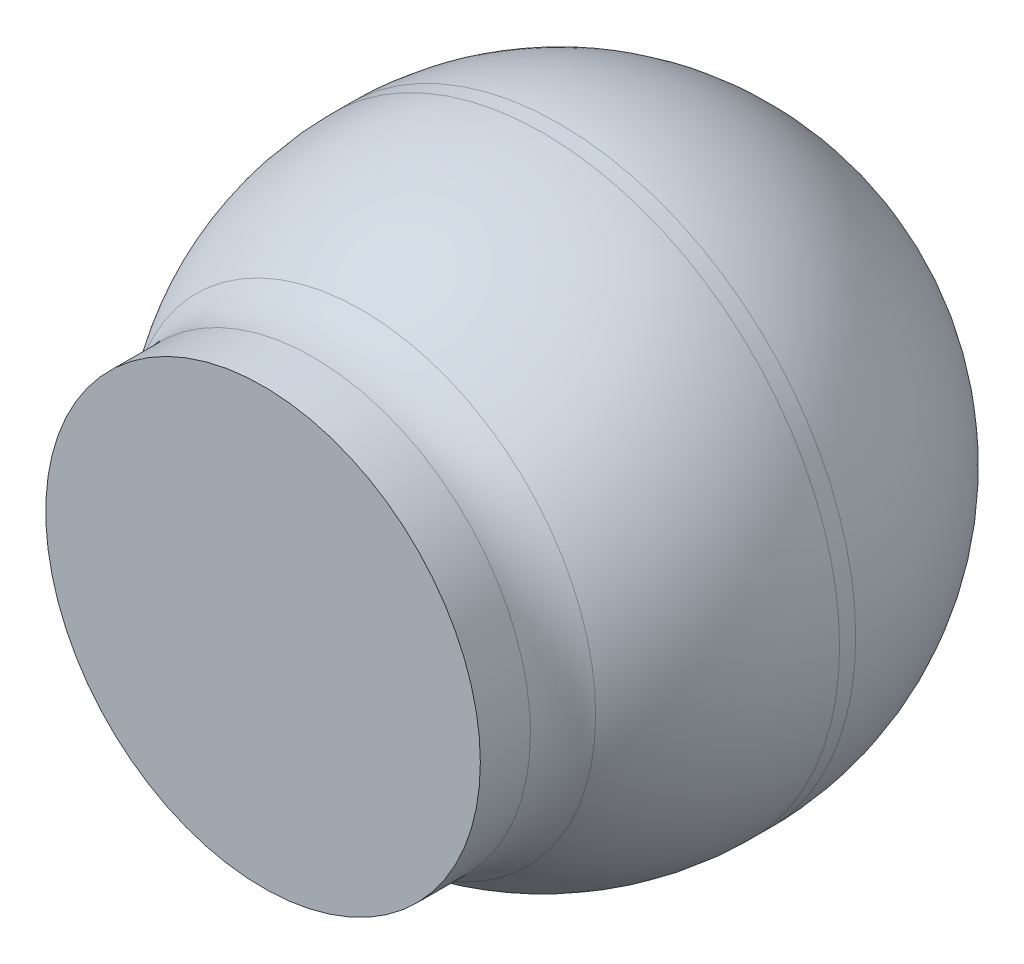
ISO-10303-21;
HEADER;
FILE_DESCRIPTION(('STEP AP214'),'2;1');
FILE_NAME('part.step','',(''),(''),'','','');
FILE_SCHEMA(('AUTOMOTIVE_DESIGN { 1 0 10303 214 1 1 1 1 }'));
ENDSEC;
DATA;
#1=APPLICATION_CONTEXT('core data for automotive mechanical design processes');
#2=APPLICATION_PROTOCOL_DEFINITION('international standard','automotive_design',2000,#1);
#3=PRODUCT_CONTEXT('',#1,'mechanical');
#4=PRODUCT('Part','Part','',(#3));
#5=PRODUCT_RELATED_PRODUCT_CATEGORY('part','',(#4));
#6=PRODUCT_DEFINITION_FORMATION('','',#4);
#7=PRODUCT_DEFINITION_CONTEXT('part definition',#1,'design');
#8=PRODUCT_DEFINITION('design','',#6,#7);
#9=PRODUCT_DEFINITION_SHAPE('','',#8);
#10=(LENGTH_UNIT() NAMED_UNIT(*) SI_UNIT(.MILLI.,.METRE.));
#11=(NAMED_UNIT(*) PLANE_ANGLE_UNIT() SI_UNIT($,.RADIAN.));
#12=(NAMED_UNIT(*) SI_UNIT($,.STERADIAN.) SOLID_ANGLE_UNIT());
#13=UNCERTAINTY_MEASURE_WITH_UNIT(LENGTH_MEASURE(1.E-05),#10,'distance_accuracy_value','');
#14=(GEOMETRIC_REPRESENTATION_CONTEXT(3) GLOBAL_UNCERTAINTY_ASSIGNED_CONTEXT((#13)) GLOBAL_UNIT_ASSIGNED_CONTEXT((#10,
#11,#12)) REPRESENTATION_CONTEXT('',''));
#15=CARTESIAN_POINT('',(0.,0.,0.));
#16=DIRECTION('',(0.,0.,1.));
#17=DIRECTION('',(1.,0.,0.));
#18=AXIS2_PLACEMENT_3D('',#15,#16,#17);
#19=CARTESIAN_POINT('',(-0.562919922269,-1.511349291452,10.006534503384));
#20=DIRECTION('',(0.,0.,-1.));
#21=DIRECTION('',(-1.,0.,0.));
#22=AXIS2_PLACEMENT_3D('',#19,#20,#21);
#23=PLANE('',#22);
#24=CARTESIAN_POINT('',(-0.562919922269,-1.511349291452,10.006534503384));
#25=DIRECTION('',(0.,0.,1.));
#26=DIRECTION('',(1.,0.,0.));
#27=AXIS2_PLACEMENT_3D('',#24,#25,#26);
#28=CIRCLE('',#27,0.275);
#29=CARTESIAN_POINT('',(-0.287919922269,-1.511349291452,10.006534503384));
#30=VERTEX_POINT('',#29);
#31=EDGE_CURVE('E20',#30,#30,#28,.F.);
#32=ORIENTED_EDGE('',*,*,#31,.F.);
#33=EDGE_LOOP('',(#32));
#34=FACE_BOUND('',#33,.T.);
#35=ADVANCED_FACE('F17',(#34),#23,.F.);
#36=CARTESIAN_POINT('',(-0.562919922269,-1.511349291452,9.906534503384));
#37=DIRECTION('',(0.,0.,1.));
#38=DIRECTION('',(1.,0.,0.));
#39=AXIS2_PLACEMENT_3D('',#36,#37,#38);
#40=CYLINDRICAL_SURFACE('',#39,0.275);
#41=CARTESIAN_POINT('',(-0.562919922269,-1.511349291452,9.943180457728));
#42=DIRECTION('',(0.,0.,-1.));
#43=DIRECTION('',(0.996700902337583,0.0811622527992462,0.));
#44=AXIS2_PLACEMENT_3D('',#41,#42,#43);
#45=CIRCLE('',#44,0.275);
#46=CARTESIAN_POINT('',(-0.288827174126165,-1.48902967193221,9.943180457728));
#47=VERTEX_POINT('',#46);
#48=EDGE_CURVE('E65',#47,#47,#45,.F.);
#49=ORIENTED_EDGE('',*,*,#48,.T.);
#50=EDGE_LOOP('',(#49));
#51=FACE_BOUND('',#50,.T.);
#52=ORIENTED_EDGE('',*,*,#31,.T.);
#53=EDGE_LOOP('',(#52));
#54=FACE_BOUND('',#53,.T.);
#55=ADVANCED_FACE('F62',(#51,#54),#40,.T.);
#56=CARTESIAN_POINT('',(-0.562919922269,-1.511349291452,9.943180457728));
#57=DIRECTION('',(0.,0.,-1.));
#58=DIRECTION('',(0.996700902337582,0.081162252799246,0.));
#59=AXIS2_PLACEMENT_3D('',#56,#57,#58);
#60=TOROIDAL_SURFACE('',#59,0.375,0.1);
#61=ORIENTED_EDGE('',*,*,#48,.F.);
#62=EDGE_LOOP('',(#61));
#63=FACE_BOUND('',#62,.T.);
#64=CARTESIAN_POINT('',(-0.562919922268999,-1.511349291452,9.881744931236));
#65=DIRECTION('',(0.,0.,-1.));
#66=DIRECTION('',(-0.996700902337597,-0.0811622527990614,0.));
#67=AXIS2_PLACEMENT_3D('',#64,#65,#66);
#68=CIRCLE('',#67,0.296097046412665);
#69=CARTESIAN_POINT('',(-0.858040115608,-1.535381194786,9.881744931236));
#70=VERTEX_POINT('',#69);
#71=EDGE_CURVE('E39',#70,#70,#68,.T.);
#72=ORIENTED_EDGE('',*,*,#71,.F.);
#73=EDGE_LOOP('',(#72));
#74=FACE_BOUND('',#73,.T.);
#75=ADVANCED_FACE('F57',(#63,#74),#60,.F.);
#76=CARTESIAN_POINT('',(-0.936682760645,-1.541785136252,9.651976062157));
#77=CARTESIAN_POINT('',(-0.936682760645,-1.541785136252,9.701461392103));
#78=CARTESIAN_POINT('',(-0.928526217348,-1.541120941579,9.750947004335));
#79=CARTESIAN_POINT('',(-0.912207085349,-1.539792059952,9.798626332798));
#80=CARTESIAN_POINT('',(-0.888341390838,-1.537848654938,9.842699544317));
#81=CARTESIAN_POINT('',(-0.858040115608,-1.535381194786,9.881744931236));
#82=(BOUNDED_CURVE() B_SPLINE_CURVE(5,(#76,#77,#78,#79,#80,#81),.UNSPECIFIED.,.F.,
.F.) B_SPLINE_CURVE_WITH_KNOTS((6,6),(0.,0.661568582165),
.UNSPECIFIED.) CURVE() GEOMETRIC_REPRESENTATION_ITEM() RATIONAL_B_SPLINE_CURVE((1.,1.,1.,1.,1.,1.)) REPRESENTATION_ITEM(''));
#83=CARTESIAN_POINT('',(-0.562919922269,-1.511349291452,9.651976062157));
#84=DIRECTION('',(0.,0.,-1.));
#85=AXIS1_PLACEMENT('',#83,#84);
#86=SURFACE_OF_REVOLUTION('',#82,#85);
#87=CARTESIAN_POINT('',(-0.562919922268999,-1.511349291452,9.651976062157));
#88=DIRECTION('',(0.,0.,1.));
#89=DIRECTION('',(1.,0.,0.));
#90=AXIS2_PLACEMENT_3D('',#87,#88,#89);
#91=CIRCLE('',#90,0.375);
#92=CARTESIAN_POINT('',(-0.187919922268999,-1.511349291452,9.651976062157));
#93=VERTEX_POINT('',#92);
#94=EDGE_CURVE('E36',#93,#93,#91,.F.);
#95=ORIENTED_EDGE('',*,*,#94,.F.);
#96=EDGE_LOOP('',(#95));
#97=FACE_BOUND('',#96,.T.);
#98=ORIENTED_EDGE('',*,*,#71,.T.);
#99=EDGE_LOOP('',(#98));
#100=FACE_BOUND('',#99,.T.);
#101=ADVANCED_FACE('F53',(#97,#100),#86,.F.);
#102=CARTESIAN_POINT('',(-0.562919922269,-1.511349291452,9.256534503384));
#103=DIRECTION('',(0.,0.,1.));
#104=DIRECTION('',(1.,0.,0.));
#105=AXIS2_PLACEMENT_3D('',#102,#103,#104);
#106=CYLINDRICAL_SURFACE('',#105,0.375);
#107=CARTESIAN_POINT('',(-0.562919922269,-1.511349291452,9.631534503384));
#108=DIRECTION('',(0.,0.,-1.));
#109=DIRECTION('',(0.0811622527992362,-0.996700902337583,0.));
#110=AXIS2_PLACEMENT_3D('',#107,#108,#109);
#111=CIRCLE('',#110,0.375);
#112=CARTESIAN_POINT('',(-0.532484077469288,-1.88511212982859,9.631534503384));
#113=VERTEX_POINT('',#112);
#114=CARTESIAN_POINT('',(-0.593355767068714,-1.13758645307541,9.631534503384));
#115=VERTEX_POINT('',#114);
#116=EDGE_CURVE('E11',#113,#115,#111,.T.);
#117=ORIENTED_EDGE('',*,*,#116,.F.);
#118=CARTESIAN_POINT('',(-0.562919922269,-1.511349291452,9.631534503384));
#119=DIRECTION('',(0.,0.,1.));
#120=DIRECTION('',(0.081162252799236,-0.996700902337583,0.));
#121=AXIS2_PLACEMENT_3D('',#118,#119,#120);
#122=CIRCLE('',#121,0.375);
#123=EDGE_CURVE('E25',#115,#113,#122,.F.);
#124=ORIENTED_EDGE('',*,*,#123,.F.);
#125=EDGE_LOOP('',(#117,#124));
#126=FACE_BOUND('',#125,.T.);
#127=ORIENTED_EDGE('',*,*,#94,.T.);
#128=EDGE_LOOP('',(#127));
#129=FACE_BOUND('',#128,.T.);
#130=ADVANCED_FACE('F34',(#126,#129),#106,.T.);
#131=CARTESIAN_POINT('',(-0.562919922269,-1.511349291452,9.631534503384));
#132=DIRECTION('',(0.0811622527992361,-0.996700902337583,0.));
#133=DIRECTION('',(-0.996700902337583,-0.0811622527992361,0.));
#134=AXIS2_PLACEMENT_3D('',#131,#132,#133);
#135=SPHERICAL_SURFACE('',#134,0.375);
#136=ORIENTED_EDGE('',*,*,#123,.T.);
#137=ORIENTED_EDGE('',*,*,#116,.T.);
#138=EDGE_LOOP('',(#136,#137));
#139=FACE_BOUND('',#138,.T.);
#140=ADVANCED_FACE('F32',(#139),#135,.T.);
#141=CLOSED_SHELL('',(#35,#55,#75,#101,#130,#140));
#142=MANIFOLD_SOLID_BREP('B1',#141);
#143=ADVANCED_BREP_SHAPE_REPRESENTATION('',(#18,#142),#14);
#144=SHAPE_DEFINITION_REPRESENTATION(#9,#143);
ENDSEC;
END-ISO-10303-21;
